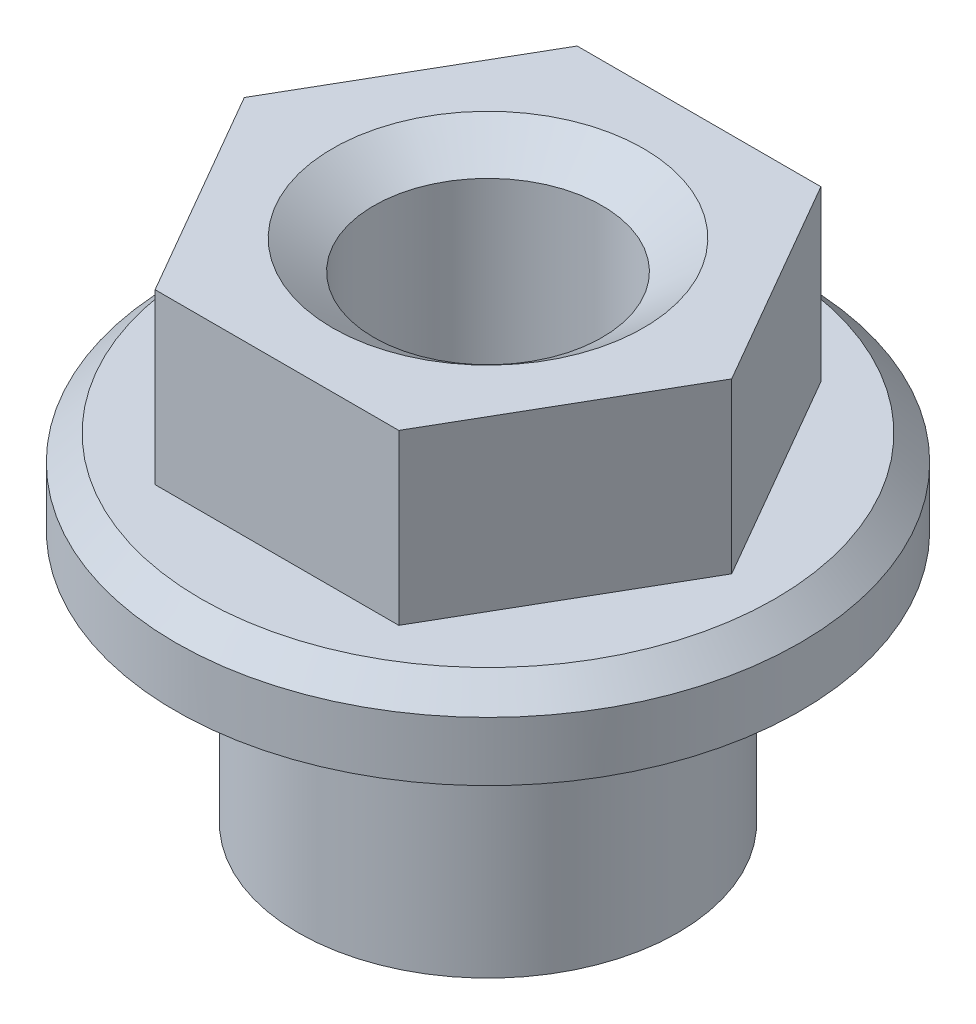
ISO-10303-21;
HEADER;
FILE_DESCRIPTION(('STEP AP214'),'2;1');
FILE_NAME('part.step','',(''),(''),'','','');
FILE_SCHEMA(('AUTOMOTIVE_DESIGN { 1 0 10303 214 1 1 1 1 }'));
ENDSEC;
DATA;
#1=APPLICATION_CONTEXT('core data for automotive mechanical design processes');
#2=APPLICATION_PROTOCOL_DEFINITION('international standard','automotive_design',2000,#1);
#3=PRODUCT_CONTEXT('',#1,'mechanical');
#4=PRODUCT('Part','Part','',(#3));
#5=PRODUCT_RELATED_PRODUCT_CATEGORY('part','',(#4));
#6=PRODUCT_DEFINITION_FORMATION('','',#4);
#7=PRODUCT_DEFINITION_CONTEXT('part definition',#1,'design');
#8=PRODUCT_DEFINITION('design','',#6,#7);
#9=PRODUCT_DEFINITION_SHAPE('','',#8);
#10=(LENGTH_UNIT() NAMED_UNIT(*) SI_UNIT(.MILLI.,.METRE.));
#11=(NAMED_UNIT(*) PLANE_ANGLE_UNIT() SI_UNIT($,.RADIAN.));
#12=(NAMED_UNIT(*) SI_UNIT($,.STERADIAN.) SOLID_ANGLE_UNIT());
#13=UNCERTAINTY_MEASURE_WITH_UNIT(LENGTH_MEASURE(1.E-05),#10,'distance_accuracy_value','');
#14=(GEOMETRIC_REPRESENTATION_CONTEXT(3) GLOBAL_UNCERTAINTY_ASSIGNED_CONTEXT((#13)) GLOBAL_UNIT_ASSIGNED_CONTEXT((#10,
#11,#12)) REPRESENTATION_CONTEXT('',''));
#15=CARTESIAN_POINT('',(0.,0.,0.));
#16=DIRECTION('',(0.,0.,1.));
#17=DIRECTION('',(1.,0.,0.));
#18=AXIS2_PLACEMENT_3D('',#15,#16,#17);
#19=CARTESIAN_POINT('',(0.,0.,0.));
#20=DIRECTION('',(0.,-1.,0.));
#21=DIRECTION('',(0.,0.,-1.));
#22=AXIS2_PLACEMENT_3D('',#19,#20,#21);
#23=CYLINDRICAL_SURFACE('',#22,3.7);
#24=CARTESIAN_POINT('',(0.,3.7,0.));
#25=DIRECTION('',(0.,1.,0.));
#26=DIRECTION('',(0.,0.,1.));
#27=AXIS2_PLACEMENT_3D('',#24,#25,#26);
#28=CIRCLE('',#27,3.7);
#29=CARTESIAN_POINT('',(0.,3.7,3.7));
#30=VERTEX_POINT('',#29);
#31=EDGE_CURVE('E13',#30,#30,#28,.F.);
#32=ORIENTED_EDGE('',*,*,#31,.T.);
#33=EDGE_LOOP('',(#32));
#34=FACE_BOUND('',#33,.T.);
#35=CARTESIAN_POINT('',(0.,3.,0.));
#36=DIRECTION('',(0.,-1.,0.));
#37=DIRECTION('',(0.,0.,-1.));
#38=AXIS2_PLACEMENT_3D('',#35,#36,#37);
#39=CIRCLE('',#38,3.7);
#40=CARTESIAN_POINT('',(0.,3.,-3.7));
#41=VERTEX_POINT('',#40);
#42=EDGE_CURVE('E139',#41,#41,#39,.T.);
#43=ORIENTED_EDGE('',*,*,#42,.F.);
#44=EDGE_LOOP('',(#43));
#45=FACE_BOUND('',#44,.T.);
#46=ADVANCED_FACE('F34',(#34,#45),#23,.T.);
#47=CARTESIAN_POINT('',(-3.7,6.,0.));
#48=DIRECTION('',(0.,-1.,0.));
#49=DIRECTION('',(0.,0.,-1.));
#50=AXIS2_PLACEMENT_3D('',#47,#48,#49);
#51=PLANE('',#50);
#52=CARTESIAN_POINT('',(0.,6.,0.));
#53=DIRECTION('',(0.,1.,0.));
#54=DIRECTION('',(0.,0.,1.));
#55=AXIS2_PLACEMENT_3D('',#52,#53,#54);
#56=CIRCLE('',#55,1.8415);
#57=CARTESIAN_POINT('',(0.,6.,1.8415));
#58=VERTEX_POINT('',#57);
#59=EDGE_CURVE('E129',#58,#58,#56,.T.);
#60=ORIENTED_EDGE('',*,*,#59,.F.);
#61=EDGE_LOOP('',(#60));
#62=FACE_BOUND('',#61,.T.);
#63=DIRECTION('',(-0.5,0.,-0.866025403784439));
#64=VECTOR('',#63,1.);
#65=CARTESIAN_POINT('',(2.88675134594813,6.,0.));
#66=LINE('',#65,#64);
#67=CARTESIAN_POINT('',(2.88675134594813,6.,0.));
#68=VERTEX_POINT('',#67);
#69=CARTESIAN_POINT('',(1.44337567297406,6.,-2.5));
#70=VERTEX_POINT('',#69);
#71=EDGE_CURVE('E49',#68,#70,#66,.T.);
#72=ORIENTED_EDGE('',*,*,#71,.T.);
#73=DIRECTION('',(-1.,0.,0.));
#74=VECTOR('',#73,1.);
#75=CARTESIAN_POINT('',(1.44337567297406,6.,-2.5));
#76=LINE('',#75,#74);
#77=CARTESIAN_POINT('',(-1.44337567297406,6.,-2.5));
#78=VERTEX_POINT('',#77);
#79=EDGE_CURVE('E93',#70,#78,#76,.T.);
#80=ORIENTED_EDGE('',*,*,#79,.T.);
#81=DIRECTION('',(-0.5,0.,0.866025403784439));
#82=VECTOR('',#81,1.);
#83=CARTESIAN_POINT('',(-1.44337567297406,6.,-2.5));
#84=LINE('',#83,#82);
#85=CARTESIAN_POINT('',(-2.88675134594813,6.,0.));
#86=VERTEX_POINT('',#85);
#87=EDGE_CURVE('E99',#78,#86,#84,.T.);
#88=ORIENTED_EDGE('',*,*,#87,.T.);
#89=DIRECTION('',(0.499999999999999,0.,0.866025403784439));
#90=VECTOR('',#89,1.);
#91=CARTESIAN_POINT('',(-2.88675134594813,6.,0.));
#92=LINE('',#91,#90);
#93=CARTESIAN_POINT('',(-1.44337567297407,6.,2.5));
#94=VERTEX_POINT('',#93);
#95=EDGE_CURVE('E111',#86,#94,#92,.T.);
#96=ORIENTED_EDGE('',*,*,#95,.T.);
#97=DIRECTION('',(1.,0.,0.));
#98=VECTOR('',#97,1.);
#99=CARTESIAN_POINT('',(-1.44337567297407,6.,2.5));
#100=LINE('',#99,#98);
#101=CARTESIAN_POINT('',(1.44337567297406,6.,2.5));
#102=VERTEX_POINT('',#101);
#103=EDGE_CURVE('E114',#94,#102,#100,.T.);
#104=ORIENTED_EDGE('',*,*,#103,.T.);
#105=DIRECTION('',(0.5,0.,-0.866025403784439));
#106=VECTOR('',#105,1.);
#107=CARTESIAN_POINT('',(1.44337567297406,6.,2.5));
#108=LINE('',#107,#106);
#109=EDGE_CURVE('E105',#102,#68,#108,.T.);
#110=ORIENTED_EDGE('',*,*,#109,.T.);
#111=EDGE_LOOP('',(#72,#80,#88,#96,#104,#110));
#112=FACE_BOUND('',#111,.T.);
#113=ADVANCED_FACE('F102',(#62,#112),#51,.F.);
#114=CARTESIAN_POINT('',(0.,0.,0.));
#115=DIRECTION('',(0.,1.,0.));
#116=DIRECTION('',(0.,0.,1.));
#117=AXIS2_PLACEMENT_3D('',#114,#115,#116);
#118=PLANE('',#117);
#119=CARTESIAN_POINT('',(0.,0.,0.));
#120=DIRECTION('',(0.,1.,0.));
#121=DIRECTION('',(0.,0.,1.));
#122=AXIS2_PLACEMENT_3D('',#119,#120,#121);
#123=CIRCLE('',#122,1.8415);
#124=CARTESIAN_POINT('',(0.,0.,1.8415));
#125=VERTEX_POINT('',#124);
#126=EDGE_CURVE('E126',#125,#125,#123,.T.);
#127=ORIENTED_EDGE('',*,*,#126,.T.);
#128=EDGE_LOOP('',(#127));
#129=FACE_BOUND('',#128,.T.);
#130=CARTESIAN_POINT('',(0.,0.,0.));
#131=DIRECTION('',(0.,-1.,0.));
#132=DIRECTION('',(0.,0.,-1.));
#133=AXIS2_PLACEMENT_3D('',#130,#131,#132);
#134=CIRCLE('',#133,2.25);
#135=CARTESIAN_POINT('',(0.,0.,-2.25));
#136=VERTEX_POINT('',#135);
#137=EDGE_CURVE('E145',#136,#136,#134,.T.);
#138=ORIENTED_EDGE('',*,*,#137,.T.);
#139=EDGE_LOOP('',(#138));
#140=FACE_BOUND('',#139,.T.);
#141=ADVANCED_FACE('F169',(#129,#140),#118,.F.);
#142=CARTESIAN_POINT('',(0.,0.,0.));
#143=DIRECTION('',(0.,-1.,0.));
#144=DIRECTION('',(0.,0.,-1.));
#145=AXIS2_PLACEMENT_3D('',#142,#143,#144);
#146=CYLINDRICAL_SURFACE('',#145,2.25);
#147=ORIENTED_EDGE('',*,*,#137,.F.);
#148=EDGE_LOOP('',(#147));
#149=FACE_BOUND('',#148,.T.);
#150=CARTESIAN_POINT('',(0.,3.,0.));
#151=DIRECTION('',(0.,-1.,0.));
#152=DIRECTION('',(0.,0.,-1.));
#153=AXIS2_PLACEMENT_3D('',#150,#151,#152);
#154=CIRCLE('',#153,2.25);
#155=CARTESIAN_POINT('',(0.,3.,-2.25));
#156=VERTEX_POINT('',#155);
#157=EDGE_CURVE('E142',#156,#156,#154,.T.);
#158=ORIENTED_EDGE('',*,*,#157,.T.);
#159=EDGE_LOOP('',(#158));
#160=FACE_BOUND('',#159,.T.);
#161=ADVANCED_FACE('F179',(#149,#160),#146,.T.);
#162=CARTESIAN_POINT('',(-2.25,3.,0.));
#163=DIRECTION('',(0.,1.,0.));
#164=DIRECTION('',(0.,0.,1.));
#165=AXIS2_PLACEMENT_3D('',#162,#163,#164);
#166=PLANE('',#165);
#167=ORIENTED_EDGE('',*,*,#157,.F.);
#168=EDGE_LOOP('',(#167));
#169=FACE_BOUND('',#168,.T.);
#170=ORIENTED_EDGE('',*,*,#42,.T.);
#171=EDGE_LOOP('',(#170));
#172=FACE_BOUND('',#171,.T.);
#173=ADVANCED_FACE('F175',(#169,#172),#166,.F.);
#174=CARTESIAN_POINT('',(0.,0.34236647580764,0.));
#175=DIRECTION('',(0.,-1.,0.));
#176=DIRECTION('',(0.,0.,-1.));
#177=AXIS2_PLACEMENT_3D('',#174,#175,#176);
#178=CONICAL_SURFACE('',#177,1.35255,0.959931088596879);
#179=ORIENTED_EDGE('',*,*,#126,.F.);
#180=EDGE_LOOP('',(#179));
#181=FACE_BOUND('',#180,.T.);
#182=CARTESIAN_POINT('',(0.,0.34236647580764,0.));
#183=DIRECTION('',(0.,1.,0.));
#184=DIRECTION('',(0.,0.,1.));
#185=AXIS2_PLACEMENT_3D('',#182,#183,#184);
#186=CIRCLE('',#185,1.35255);
#187=CARTESIAN_POINT('',(0.,0.34236647580764,1.35255));
#188=VERTEX_POINT('',#187);
#189=EDGE_CURVE('E136',#188,#188,#186,.T.);
#190=ORIENTED_EDGE('',*,*,#189,.T.);
#191=EDGE_LOOP('',(#190));
#192=FACE_BOUND('',#191,.T.);
#193=ADVANCED_FACE('F178',(#181,#192),#178,.F.);
#194=CARTESIAN_POINT('',(0.,6.,0.));
#195=DIRECTION('',(0.,1.,0.));
#196=DIRECTION('',(0.,0.,1.));
#197=AXIS2_PLACEMENT_3D('',#194,#195,#196);
#198=CYLINDRICAL_SURFACE('',#197,1.35255);
#199=ORIENTED_EDGE('',*,*,#189,.F.);
#200=EDGE_LOOP('',(#199));
#201=FACE_BOUND('',#200,.T.);
#202=CARTESIAN_POINT('',(0.,5.65763352419236,0.));
#203=DIRECTION('',(0.,1.,0.));
#204=DIRECTION('',(0.,0.,1.));
#205=AXIS2_PLACEMENT_3D('',#202,#203,#204);
#206=CIRCLE('',#205,1.35255);
#207=CARTESIAN_POINT('',(0.,5.65763352419236,1.35255));
#208=VERTEX_POINT('',#207);
#209=EDGE_CURVE('E133',#208,#208,#206,.T.);
#210=ORIENTED_EDGE('',*,*,#209,.T.);
#211=EDGE_LOOP('',(#210));
#212=FACE_BOUND('',#211,.T.);
#213=ADVANCED_FACE('F197',(#201,#212),#198,.F.);
#214=CARTESIAN_POINT('',(0.,6.,0.));
#215=DIRECTION('',(0.,1.,0.));
#216=DIRECTION('',(0.,0.,1.));
#217=AXIS2_PLACEMENT_3D('',#214,#215,#216);
#218=CONICAL_SURFACE('',#217,1.8415,0.959931088596879);
#219=ORIENTED_EDGE('',*,*,#209,.F.);
#220=EDGE_LOOP('',(#219));
#221=FACE_BOUND('',#220,.T.);
#222=ORIENTED_EDGE('',*,*,#59,.T.);
#223=EDGE_LOOP('',(#222));
#224=FACE_BOUND('',#223,.T.);
#225=ADVANCED_FACE('F202',(#221,#224),#218,.F.);
#226=CARTESIAN_POINT('',(-2.25,4.,0.));
#227=DIRECTION('',(0.,1.,0.));
#228=DIRECTION('',(0.,0.,1.));
#229=AXIS2_PLACEMENT_3D('',#226,#227,#228);
#230=PLANE('',#229);
#231=CARTESIAN_POINT('',(0.,4.,0.));
#232=DIRECTION('',(0.,1.,0.));
#233=DIRECTION('',(0.,0.,1.));
#234=AXIS2_PLACEMENT_3D('',#231,#232,#233);
#235=CIRCLE('',#234,3.4);
#236=CARTESIAN_POINT('',(0.,4.,3.4));
#237=VERTEX_POINT('',#236);
#238=EDGE_CURVE('E42',#237,#237,#235,.T.);
#239=ORIENTED_EDGE('',*,*,#238,.T.);
#240=EDGE_LOOP('',(#239));
#241=FACE_BOUND('',#240,.T.);
#242=DIRECTION('',(0.5,0.,0.866025403784439));
#243=VECTOR('',#242,1.);
#244=CARTESIAN_POINT('',(2.88675134594813,4.,0.));
#245=LINE('',#244,#243);
#246=CARTESIAN_POINT('',(1.44337567297406,4.,-2.5));
#247=VERTEX_POINT('',#246);
#248=CARTESIAN_POINT('',(2.88675134594813,4.,0.));
#249=VERTEX_POINT('',#248);
#250=EDGE_CURVE('E54',#247,#249,#245,.T.);
#251=ORIENTED_EDGE('',*,*,#250,.T.);
#252=DIRECTION('',(-0.5,0.,0.866025403784439));
#253=VECTOR('',#252,1.);
#254=CARTESIAN_POINT('',(1.44337567297406,4.,2.5));
#255=LINE('',#254,#253);
#256=CARTESIAN_POINT('',(1.44337567297406,4.,2.5));
#257=VERTEX_POINT('',#256);
#258=EDGE_CURVE('E125',#249,#257,#255,.T.);
#259=ORIENTED_EDGE('',*,*,#258,.T.);
#260=DIRECTION('',(-1.,0.,0.));
#261=VECTOR('',#260,1.);
#262=CARTESIAN_POINT('',(-1.44337567297407,4.,2.5));
#263=LINE('',#262,#261);
#264=CARTESIAN_POINT('',(-1.44337567297407,4.,2.5));
#265=VERTEX_POINT('',#264);
#266=EDGE_CURVE('E235',#257,#265,#263,.T.);
#267=ORIENTED_EDGE('',*,*,#266,.T.);
#268=DIRECTION('',(-0.5,0.,-0.866025403784439));
#269=VECTOR('',#268,1.);
#270=CARTESIAN_POINT('',(-2.88675134594813,4.,0.));
#271=LINE('',#270,#269);
#272=CARTESIAN_POINT('',(-2.88675134594813,4.,0.));
#273=VERTEX_POINT('',#272);
#274=EDGE_CURVE('E240',#265,#273,#271,.T.);
#275=ORIENTED_EDGE('',*,*,#274,.T.);
#276=DIRECTION('',(0.5,0.,-0.866025403784439));
#277=VECTOR('',#276,1.);
#278=CARTESIAN_POINT('',(-1.44337567297406,4.,-2.5));
#279=LINE('',#278,#277);
#280=CARTESIAN_POINT('',(-1.44337567297406,4.,-2.5));
#281=VERTEX_POINT('',#280);
#282=EDGE_CURVE('E243',#273,#281,#279,.T.);
#283=ORIENTED_EDGE('',*,*,#282,.T.);
#284=DIRECTION('',(1.,0.,0.));
#285=VECTOR('',#284,1.);
#286=CARTESIAN_POINT('',(1.44337567297406,4.,-2.5));
#287=LINE('',#286,#285);
#288=EDGE_CURVE('E130',#281,#247,#287,.T.);
#289=ORIENTED_EDGE('',*,*,#288,.T.);
#290=EDGE_LOOP('',(#251,#259,#267,#275,#283,#289));
#291=FACE_BOUND('',#290,.T.);
#292=ADVANCED_FACE('F150',(#241,#291),#230,.T.);
#293=CARTESIAN_POINT('',(2.88675134594813,-7.60660171779821,0.));
#294=DIRECTION('',(0.866025403784439,0.,-0.5));
#295=DIRECTION('',(-0.5,0.,-0.866025403784439));
#296=AXIS2_PLACEMENT_3D('',#293,#294,#295);
#297=PLANE('',#296);
#298=DIRECTION('',(0.,1.,0.));
#299=VECTOR('',#298,1.);
#300=CARTESIAN_POINT('',(1.44337567297406,-7.60660171779821,-2.5));
#301=LINE('',#300,#299);
#302=EDGE_CURVE('E85',#247,#70,#301,.T.);
#303=ORIENTED_EDGE('',*,*,#302,.T.);
#304=ORIENTED_EDGE('',*,*,#71,.F.);
#305=DIRECTION('',(0.,1.,0.));
#306=VECTOR('',#305,1.);
#307=CARTESIAN_POINT('',(2.88675134594813,-7.60660171779821,0.));
#308=LINE('',#307,#306);
#309=EDGE_CURVE('E90',#249,#68,#308,.T.);
#310=ORIENTED_EDGE('',*,*,#309,.F.);
#311=ORIENTED_EDGE('',*,*,#250,.F.);
#312=EDGE_LOOP('',(#303,#304,#310,#311));
#313=FACE_BOUND('',#312,.T.);
#314=ADVANCED_FACE('F87',(#313),#297,.T.);
#315=CARTESIAN_POINT('',(1.44337567297406,-7.60660171779821,-2.5));
#316=DIRECTION('',(0.,0.,-1.));
#317=DIRECTION('',(-1.,0.,0.));
#318=AXIS2_PLACEMENT_3D('',#315,#316,#317);
#319=PLANE('',#318);
#320=DIRECTION('',(0.,1.,0.));
#321=VECTOR('',#320,1.);
#322=CARTESIAN_POINT('',(-1.44337567297406,-7.60660171779821,-2.5));
#323=LINE('',#322,#321);
#324=EDGE_CURVE('E89',#281,#78,#323,.T.);
#325=ORIENTED_EDGE('',*,*,#324,.T.);
#326=ORIENTED_EDGE('',*,*,#79,.F.);
#327=ORIENTED_EDGE('',*,*,#302,.F.);
#328=ORIENTED_EDGE('',*,*,#288,.F.);
#329=EDGE_LOOP('',(#325,#326,#327,#328));
#330=FACE_BOUND('',#329,.T.);
#331=ADVANCED_FACE('F94',(#330),#319,.T.);
#332=CARTESIAN_POINT('',(-1.44337567297406,-7.60660171779821,-2.5));
#333=DIRECTION('',(-0.866025403784438,0.,-0.5));
#334=DIRECTION('',(-0.5,0.,0.866025403784439));
#335=AXIS2_PLACEMENT_3D('',#332,#333,#334);
#336=PLANE('',#335);
#337=DIRECTION('',(0.,1.,0.));
#338=VECTOR('',#337,1.);
#339=CARTESIAN_POINT('',(-2.88675134594813,-7.60660171779821,0.));
#340=LINE('',#339,#338);
#341=EDGE_CURVE('E120',#273,#86,#340,.T.);
#342=ORIENTED_EDGE('',*,*,#341,.T.);
#343=ORIENTED_EDGE('',*,*,#87,.F.);
#344=ORIENTED_EDGE('',*,*,#324,.F.);
#345=ORIENTED_EDGE('',*,*,#282,.F.);
#346=EDGE_LOOP('',(#342,#343,#344,#345));
#347=FACE_BOUND('',#346,.T.);
#348=ADVANCED_FACE('F219',(#347),#336,.T.);
#349=CARTESIAN_POINT('',(-2.88675134594813,-7.60660171779821,0.));
#350=DIRECTION('',(-0.866025403784439,0.,0.5));
#351=DIRECTION('',(0.5,0.,0.866025403784439));
#352=AXIS2_PLACEMENT_3D('',#349,#350,#351);
#353=PLANE('',#352);
#354=DIRECTION('',(0.,1.,0.));
#355=VECTOR('',#354,1.);
#356=CARTESIAN_POINT('',(-1.44337567297407,-7.60660171779821,2.5));
#357=LINE('',#356,#355);
#358=EDGE_CURVE('E118',#265,#94,#357,.T.);
#359=ORIENTED_EDGE('',*,*,#358,.T.);
#360=ORIENTED_EDGE('',*,*,#95,.F.);
#361=ORIENTED_EDGE('',*,*,#341,.F.);
#362=ORIENTED_EDGE('',*,*,#274,.F.);
#363=EDGE_LOOP('',(#359,#360,#361,#362));
#364=FACE_BOUND('',#363,.T.);
#365=ADVANCED_FACE('F222',(#364),#353,.T.);
#366=CARTESIAN_POINT('',(-1.44337567297407,-7.60660171779821,2.5));
#367=DIRECTION('',(0.,0.,1.));
#368=DIRECTION('',(1.,0.,0.));
#369=AXIS2_PLACEMENT_3D('',#366,#367,#368);
#370=PLANE('',#369);
#371=DIRECTION('',(0.,1.,0.));
#372=VECTOR('',#371,1.);
#373=CARTESIAN_POINT('',(1.44337567297406,-7.60660171779821,2.5));
#374=LINE('',#373,#372);
#375=EDGE_CURVE('E116',#257,#102,#374,.T.);
#376=ORIENTED_EDGE('',*,*,#375,.T.);
#377=ORIENTED_EDGE('',*,*,#103,.F.);
#378=ORIENTED_EDGE('',*,*,#358,.F.);
#379=ORIENTED_EDGE('',*,*,#266,.F.);
#380=EDGE_LOOP('',(#376,#377,#378,#379));
#381=FACE_BOUND('',#380,.T.);
#382=ADVANCED_FACE('F159',(#381),#370,.T.);
#383=CARTESIAN_POINT('',(1.44337567297406,-7.60660171779821,2.5));
#384=DIRECTION('',(0.866025403784439,0.,0.5));
#385=DIRECTION('',(0.5,0.,-0.866025403784439));
#386=AXIS2_PLACEMENT_3D('',#383,#384,#385);
#387=PLANE('',#386);
#388=ORIENTED_EDGE('',*,*,#309,.T.);
#389=ORIENTED_EDGE('',*,*,#109,.F.);
#390=ORIENTED_EDGE('',*,*,#375,.F.);
#391=ORIENTED_EDGE('',*,*,#258,.F.);
#392=EDGE_LOOP('',(#388,#389,#390,#391));
#393=FACE_BOUND('',#392,.T.);
#394=ADVANCED_FACE('F154',(#393),#387,.T.);
#395=CARTESIAN_POINT('',(0.,4.,0.));
#396=DIRECTION('',(0.,-1.,0.));
#397=DIRECTION('',(0.,0.,-1.));
#398=AXIS2_PLACEMENT_3D('',#395,#396,#397);
#399=CONICAL_SURFACE('',#398,3.4,0.785398163397448);
#400=ORIENTED_EDGE('',*,*,#31,.F.);
#401=EDGE_LOOP('',(#400));
#402=FACE_BOUND('',#401,.T.);
#403=ORIENTED_EDGE('',*,*,#238,.F.);
#404=EDGE_LOOP('',(#403));
#405=FACE_BOUND('',#404,.T.);
#406=ADVANCED_FACE('F36',(#402,#405),#399,.T.);
#407=CLOSED_SHELL('',(#46,#113,#141,#161,#173,#193,#213,#225,#292,#314,#331,#348,#365,#382,#394,#406));
#408=MANIFOLD_SOLID_BREP('B2',#407);
#409=ADVANCED_BREP_SHAPE_REPRESENTATION('',(#18,#408),#14);
#410=SHAPE_DEFINITION_REPRESENTATION(#9,#409);
ENDSEC;
END-ISO-10303-21;
